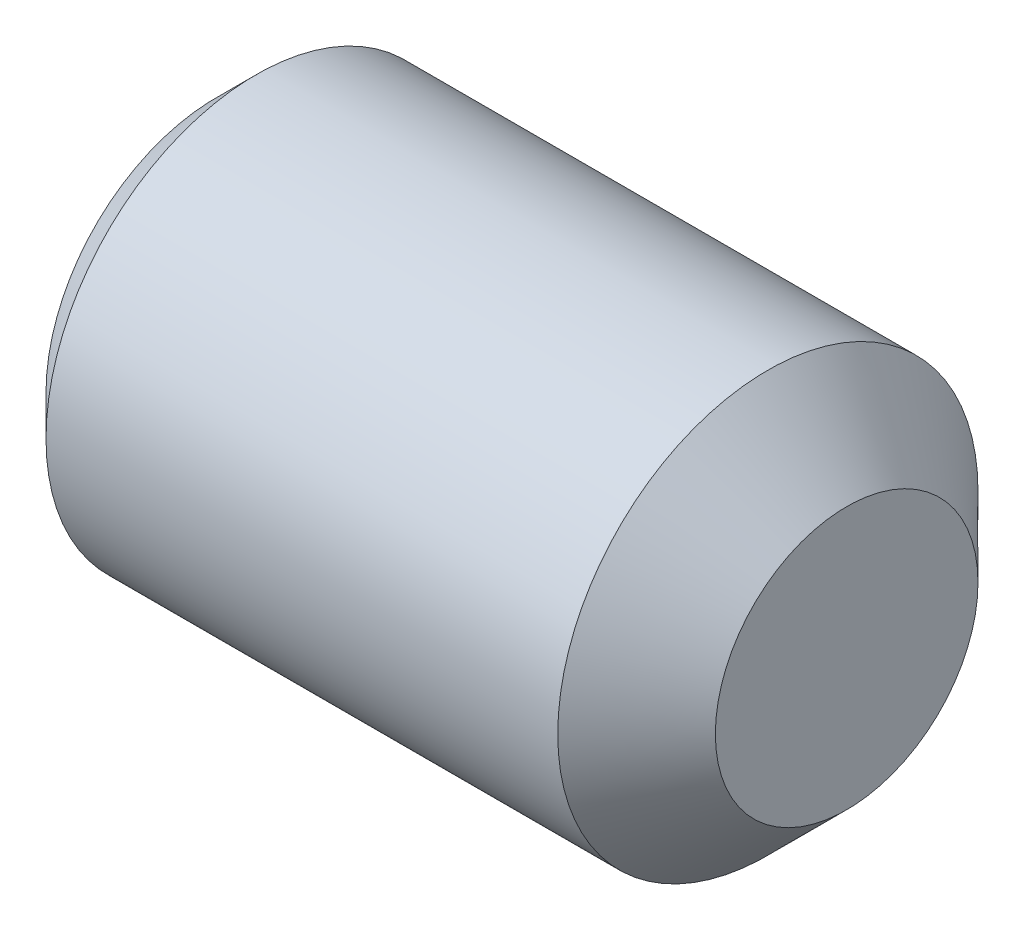
ISO-10303-21;
HEADER;
FILE_DESCRIPTION(('STEP AP214'),'2;1');
FILE_NAME('part.step','',(''),(''),'','','');
FILE_SCHEMA(('AUTOMOTIVE_DESIGN { 1 0 10303 214 1 1 1 1 }'));
ENDSEC;
DATA;
#1=APPLICATION_CONTEXT('core data for automotive mechanical design processes');
#2=APPLICATION_PROTOCOL_DEFINITION('international standard','automotive_design',2000,#1);
#3=PRODUCT_CONTEXT('',#1,'mechanical');
#4=PRODUCT('Part','Part','',(#3));
#5=PRODUCT_RELATED_PRODUCT_CATEGORY('part','',(#4));
#6=PRODUCT_DEFINITION_FORMATION('','',#4);
#7=PRODUCT_DEFINITION_CONTEXT('part definition',#1,'design');
#8=PRODUCT_DEFINITION('design','',#6,#7);
#9=PRODUCT_DEFINITION_SHAPE('','',#8);
#10=(LENGTH_UNIT() NAMED_UNIT(*) SI_UNIT(.MILLI.,.METRE.));
#11=(NAMED_UNIT(*) PLANE_ANGLE_UNIT() SI_UNIT($,.RADIAN.));
#12=(NAMED_UNIT(*) SI_UNIT($,.STERADIAN.) SOLID_ANGLE_UNIT());
#13=UNCERTAINTY_MEASURE_WITH_UNIT(LENGTH_MEASURE(1.E-05),#10,'distance_accuracy_value','');
#14=(GEOMETRIC_REPRESENTATION_CONTEXT(3) GLOBAL_UNCERTAINTY_ASSIGNED_CONTEXT((#13)) GLOBAL_UNIT_ASSIGNED_CONTEXT((#10,
#11,#12)) REPRESENTATION_CONTEXT('',''));
#15=CARTESIAN_POINT('',(0.,0.,0.));
#16=DIRECTION('',(0.,0.,1.));
#17=DIRECTION('',(1.,0.,0.));
#18=AXIS2_PLACEMENT_3D('',#15,#16,#17);
#19=CARTESIAN_POINT('',(1.50000000011356,-1.00000000000017,0.577350269189637));
#20=DIRECTION('',(1.,0.,0.));
#21=DIRECTION('',(0.,0.,-0.999999999999998));
#22=AXIS2_PLACEMENT_3D('',#19,#20,#21);
#23=PLANE('',#22);
#24=CARTESIAN_POINT('',(1.50000000011363,0.,0.));
#25=DIRECTION('',(-1.,0.,0.));
#26=DIRECTION('',(0.,0.,0.999999999999998));
#27=AXIS2_PLACEMENT_3D('',#24,#25,#26);
#28=CIRCLE('',#27,1.);
#29=CARTESIAN_POINT('',(1.50000000011362,0.499999999999806,0.866025403784443));
#30=VERTEX_POINT('',#29);
#31=CARTESIAN_POINT('',(1.50000000011372,0.999999999999779,0.));
#32=VERTEX_POINT('',#31);
#33=EDGE_CURVE('E50',#30,#32,#28,.T.);
#34=ORIENTED_EDGE('',*,*,#33,.F.);
#35=DIRECTION('',(0.,0.866025403784439,-0.499999999999999));
#36=VECTOR('',#35,1.);
#37=CARTESIAN_POINT('',(1.50000000011363,-1.11022302462516E-13,1.15470053837926));
#38=LINE('',#37,#36);
#39=CARTESIAN_POINT('',(1.50000000011367,0.999999999999834,0.577350269189644));
#40=VERTEX_POINT('',#39);
#41=EDGE_CURVE('E163',#30,#40,#38,.T.);
#42=ORIENTED_EDGE('',*,*,#41,.T.);
#43=DIRECTION('',(0.,0.,-0.999999999999998));
#44=VECTOR('',#43,1.);
#45=CARTESIAN_POINT('',(1.50000000011367,0.999999999999834,0.577350269189644));
#46=LINE('',#45,#44);
#47=EDGE_CURVE('E167',#40,#32,#46,.T.);
#48=ORIENTED_EDGE('',*,*,#47,.T.);
#49=EDGE_LOOP('',(#34,#42,#48));
#50=FACE_BOUND('',#49,.T.);
#51=ADVANCED_FACE('F39',(#50),#23,.F.);
#52=CARTESIAN_POINT('',(1.50000000011359,0.499999999999806,-0.866025403784434));
#53=VERTEX_POINT('',#52);
#54=EDGE_CURVE('E11',#32,#53,#28,.T.);
#55=ORIENTED_EDGE('',*,*,#54,.F.);
#56=CARTESIAN_POINT('',(1.5000000001136,0.999999999999751,-0.577350269189619));
#57=VERTEX_POINT('',#56);
#58=EDGE_CURVE('E166',#32,#57,#46,.T.);
#59=ORIENTED_EDGE('',*,*,#58,.T.);
#60=DIRECTION('',(0.,-0.866025403784439,-0.499999999999998));
#61=VECTOR('',#60,1.);
#62=CARTESIAN_POINT('',(1.5000000001136,0.999999999999751,-0.577350269189619));
#63=LINE('',#62,#61);
#64=EDGE_CURVE('E171',#57,#53,#63,.T.);
#65=ORIENTED_EDGE('',*,*,#64,.T.);
#66=EDGE_LOOP('',(#55,#59,#65));
#67=FACE_BOUND('',#66,.T.);
#68=ADVANCED_FACE('F126',(#67),#23,.F.);
#69=CARTESIAN_POINT('',(1.50000000011367,-0.500000000000139,-0.866025403784429));
#70=VERTEX_POINT('',#69);
#71=EDGE_CURVE('E48',#53,#70,#28,.T.);
#72=ORIENTED_EDGE('',*,*,#71,.F.);
#73=CARTESIAN_POINT('',(1.50000000011359,-1.66533453693773E-13,-1.15470053837924));
#74=VERTEX_POINT('',#73);
#75=EDGE_CURVE('E170',#53,#74,#63,.T.);
#76=ORIENTED_EDGE('',*,*,#75,.T.);
#77=DIRECTION('',(0.,-0.866025403784439,0.499999999999999));
#78=VECTOR('',#77,1.);
#79=CARTESIAN_POINT('',(1.50000000011359,-1.66533453693773E-13,-1.15470053837924));
#80=LINE('',#79,#78);
#81=EDGE_CURVE('E175',#74,#70,#80,.T.);
#82=ORIENTED_EDGE('',*,*,#81,.T.);
#83=EDGE_LOOP('',(#72,#76,#82));
#84=FACE_BOUND('',#83,.T.);
#85=ADVANCED_FACE('F132',(#84),#23,.F.);
#86=CARTESIAN_POINT('',(1.50000000011366,-1.0000000000002,0.));
#87=VERTEX_POINT('',#86);
#88=EDGE_CURVE('E275',#70,#87,#28,.T.);
#89=ORIENTED_EDGE('',*,*,#88,.F.);
#90=CARTESIAN_POINT('',(1.50000000011359,-1.00000000000014,-0.577350269189618));
#91=VERTEX_POINT('',#90);
#92=EDGE_CURVE('E174',#70,#91,#80,.T.);
#93=ORIENTED_EDGE('',*,*,#92,.T.);
#94=DIRECTION('',(0.,0.,0.999999999999998));
#95=VECTOR('',#94,1.);
#96=CARTESIAN_POINT('',(1.50000000011359,-1.00000000000014,-0.577350269189618));
#97=LINE('',#96,#95);
#98=EDGE_CURVE('E178',#91,#87,#97,.T.);
#99=ORIENTED_EDGE('',*,*,#98,.T.);
#100=EDGE_LOOP('',(#89,#93,#99));
#101=FACE_BOUND('',#100,.T.);
#102=ADVANCED_FACE('F145',(#101),#23,.F.);
#103=CARTESIAN_POINT('',(1.50000000011356,-0.500000000000111,0.866025403784439));
#104=VERTEX_POINT('',#103);
#105=EDGE_CURVE('E57',#87,#104,#28,.T.);
#106=ORIENTED_EDGE('',*,*,#105,.F.);
#107=CARTESIAN_POINT('',(1.50000000011356,-1.00000000000017,0.577350269189637));
#108=VERTEX_POINT('',#107);
#109=EDGE_CURVE('E161',#87,#108,#97,.T.);
#110=ORIENTED_EDGE('',*,*,#109,.T.);
#111=DIRECTION('',(0.,0.866025403784439,0.499999999999999));
#112=VECTOR('',#111,1.);
#113=CARTESIAN_POINT('',(1.50000000011356,-1.00000000000017,0.577350269189637));
#114=LINE('',#113,#112);
#115=EDGE_CURVE('E156',#108,#104,#114,.T.);
#116=ORIENTED_EDGE('',*,*,#115,.T.);
#117=EDGE_LOOP('',(#106,#110,#116));
#118=FACE_BOUND('',#117,.T.);
#119=ADVANCED_FACE('F137',(#118),#23,.F.);
#120=EDGE_CURVE('E148',#104,#30,#28,.T.);
#121=ORIENTED_EDGE('',*,*,#120,.F.);
#122=CARTESIAN_POINT('',(1.50000000011363,-1.11022302462516E-13,1.15470053837926));
#123=VERTEX_POINT('',#122);
#124=EDGE_CURVE('E150',#104,#123,#114,.T.);
#125=ORIENTED_EDGE('',*,*,#124,.T.);
#126=EDGE_CURVE('E152',#123,#30,#38,.T.);
#127=ORIENTED_EDGE('',*,*,#126,.T.);
#128=EDGE_LOOP('',(#121,#125,#127));
#129=FACE_BOUND('',#128,.T.);
#130=ADVANCED_FACE('F128',(#129),#23,.F.);
#131=CARTESIAN_POINT('',(0.,1.62099999999979,0.));
#132=DIRECTION('',(1.,0.,0.));
#133=DIRECTION('',(0.,0.,-0.999999999999998));
#134=AXIS2_PLACEMENT_3D('',#131,#132,#133);
#135=PLANE('',#134);
#136=DIRECTION('',(0.,0.866025403784439,-0.499999999999999));
#137=VECTOR('',#136,1.);
#138=CARTESIAN_POINT('',(1.13617448782577E-10,0.,1.15470053837926));
#139=LINE('',#138,#137);
#140=CARTESIAN_POINT('',(0.,0.,1.15470053837926));
#141=VERTEX_POINT('',#140);
#142=CARTESIAN_POINT('',(1.13575815419154E-10,0.999999999999751,0.577350269189626));
#143=VERTEX_POINT('',#142);
#144=EDGE_CURVE('E182',#141,#143,#139,.T.);
#145=ORIENTED_EDGE('',*,*,#144,.F.);
#146=DIRECTION('',(0.,0.866025403784439,0.499999999999999));
#147=VECTOR('',#146,1.);
#148=CARTESIAN_POINT('',(1.13575815419154E-10,-1.00000000000017,0.577350269189633));
#149=LINE('',#148,#147);
#150=CARTESIAN_POINT('',(1.13575815419154E-10,-1.00000000000017,0.577350269189633));
#151=VERTEX_POINT('',#150);
#152=EDGE_CURVE('E65',#151,#141,#149,.T.);
#153=ORIENTED_EDGE('',*,*,#152,.F.);
#154=DIRECTION('',(0.,0.,0.999999999999998));
#155=VECTOR('',#154,1.);
#156=CARTESIAN_POINT('',(1.13617448782577E-10,-1.00000000000011,-0.577350269189616));
#157=LINE('',#156,#155);
#158=CARTESIAN_POINT('',(1.13617448782577E-10,-1.00000000000011,-0.577350269189616));
#159=VERTEX_POINT('',#158);
#160=EDGE_CURVE('E158',#159,#151,#157,.T.);
#161=ORIENTED_EDGE('',*,*,#160,.F.);
#162=DIRECTION('',(0.,-0.866025403784439,0.499999999999999));
#163=VECTOR('',#162,1.);
#164=CARTESIAN_POINT('',(1.13603570994769E-10,-1.94289029309402E-13,-1.15470053837924));
#165=LINE('',#164,#163);
#166=CARTESIAN_POINT('',(1.13603570994769E-10,-1.94289029309402E-13,-1.15470053837924));
#167=VERTEX_POINT('',#166);
#168=EDGE_CURVE('E191',#167,#159,#165,.T.);
#169=ORIENTED_EDGE('',*,*,#168,.F.);
#170=DIRECTION('',(0.,-0.866025403784439,-0.499999999999998));
#171=VECTOR('',#170,1.);
#172=CARTESIAN_POINT('',(1.13603570994769E-10,0.999999999999779,-0.577350269189626));
#173=LINE('',#172,#171);
#174=CARTESIAN_POINT('',(1.13603570994769E-10,0.999999999999779,-0.577350269189626));
#175=VERTEX_POINT('',#174);
#176=EDGE_CURVE('E188',#175,#167,#173,.T.);
#177=ORIENTED_EDGE('',*,*,#176,.F.);
#178=DIRECTION('',(0.,0.,-0.999999999999998));
#179=VECTOR('',#178,1.);
#180=CARTESIAN_POINT('',(1.13575815419154E-10,0.999999999999751,0.577350269189626));
#181=LINE('',#180,#179);
#182=EDGE_CURVE('E185',#143,#175,#181,.T.);
#183=ORIENTED_EDGE('',*,*,#182,.F.);
#184=EDGE_LOOP('',(#145,#153,#161,#169,#177,#183));
#185=FACE_BOUND('',#184,.T.);
#186=CARTESIAN_POINT('',(0.,0.,0.));
#187=DIRECTION('',(-1.,0.,0.));
#188=DIRECTION('',(0.,0.,0.999999999999998));
#189=AXIS2_PLACEMENT_3D('',#186,#187,#188);
#190=CIRCLE('',#189,1.621);
#191=CARTESIAN_POINT('',(0.,0.,1.621));
#192=VERTEX_POINT('',#191);
#193=EDGE_CURVE('E198',#192,#192,#190,.T.);
#194=ORIENTED_EDGE('',*,*,#193,.T.);
#195=EDGE_LOOP('',(#194));
#196=FACE_BOUND('',#195,.T.);
#197=ADVANCED_FACE('F41',(#185,#196),#135,.F.);
#198=CARTESIAN_POINT('',(6.00000000000005,0.,0.));
#199=DIRECTION('',(-1.,0.,0.));
#200=DIRECTION('',(0.,0.,0.999999999999998));
#201=AXIS2_PLACEMENT_3D('',#198,#199,#200);
#202=PLANE('',#201);
#203=CARTESIAN_POINT('',(6.00000000000005,0.,0.));
#204=DIRECTION('',(-1.,0.,0.));
#205=DIRECTION('',(0.,0.,0.999999999999998));
#206=AXIS2_PLACEMENT_3D('',#203,#204,#205);
#207=CIRCLE('',#206,1.25);
#208=CARTESIAN_POINT('',(6.00000000000005,0.,1.24999999999998));
#209=VERTEX_POINT('',#208);
#210=EDGE_CURVE('E43',#209,#209,#207,.T.);
#211=ORIENTED_EDGE('',*,*,#210,.F.);
#212=EDGE_LOOP('',(#211));
#213=FACE_BOUND('',#212,.T.);
#214=ADVANCED_FACE('F143',(#213),#202,.F.);
#215=CARTESIAN_POINT('',(6.00000000000005,0.,0.));
#216=DIRECTION('',(-1.,0.,0.));
#217=DIRECTION('',(0.,0.,0.999999999999998));
#218=AXIS2_PLACEMENT_3D('',#215,#216,#217);
#219=CONICAL_SURFACE('',#218,1.25,0.785398163397443);
#220=CARTESIAN_POINT('',(5.25,0.,0.));
#221=DIRECTION('',(-1.,0.,0.));
#222=DIRECTION('',(0.,0.,0.999999999999998));
#223=AXIS2_PLACEMENT_3D('',#220,#221,#222);
#224=CIRCLE('',#223,2.);
#225=CARTESIAN_POINT('',(5.25,0.,1.99999999999999));
#226=VERTEX_POINT('',#225);
#227=EDGE_CURVE('E213',#226,#226,#224,.T.);
#228=ORIENTED_EDGE('',*,*,#227,.F.);
#229=EDGE_LOOP('',(#228));
#230=FACE_BOUND('',#229,.T.);
#231=ORIENTED_EDGE('',*,*,#210,.T.);
#232=EDGE_LOOP('',(#231));
#233=FACE_BOUND('',#232,.T.);
#234=ADVANCED_FACE('F220',(#230,#233),#219,.T.);
#235=CARTESIAN_POINT('',(-10.7450145430879,0.,0.));
#236=DIRECTION('',(-1.,0.,0.));
#237=DIRECTION('',(0.,0.,0.999999999999998));
#238=AXIS2_PLACEMENT_3D('',#235,#236,#237);
#239=CYLINDRICAL_SURFACE('',#238,2.);
#240=CARTESIAN_POINT('',(0.378999999999949,0.,0.));
#241=DIRECTION('',(-1.,0.,0.));
#242=DIRECTION('',(0.,0.,0.999999999999998));
#243=AXIS2_PLACEMENT_3D('',#240,#241,#242);
#244=CIRCLE('',#243,2.);
#245=CARTESIAN_POINT('',(0.378999999999949,0.,1.99999999999999));
#246=VERTEX_POINT('',#245);
#247=EDGE_CURVE('E211',#246,#246,#244,.T.);
#248=ORIENTED_EDGE('',*,*,#247,.F.);
#249=EDGE_LOOP('',(#248));
#250=FACE_BOUND('',#249,.T.);
#251=ORIENTED_EDGE('',*,*,#227,.T.);
#252=EDGE_LOOP('',(#251));
#253=FACE_BOUND('',#252,.T.);
#254=ADVANCED_FACE('F226',(#250,#253),#239,.T.);
#255=CARTESIAN_POINT('',(0.378999999999949,0.,0.));
#256=DIRECTION('',(1.,0.,0.));
#257=DIRECTION('',(0.,0.,-0.999999999999998));
#258=AXIS2_PLACEMENT_3D('',#255,#256,#257);
#259=CONICAL_SURFACE('',#258,2.,0.785398163397442);
#260=ORIENTED_EDGE('',*,*,#193,.F.);
#261=EDGE_LOOP('',(#260));
#262=FACE_BOUND('',#261,.T.);
#263=ORIENTED_EDGE('',*,*,#247,.T.);
#264=EDGE_LOOP('',(#263));
#265=FACE_BOUND('',#264,.T.);
#266=ADVANCED_FACE('F232',(#262,#265),#259,.T.);
#267=CARTESIAN_POINT('',(1.50000000011356,-1.00000000000017,0.577350269189637));
#268=DIRECTION('',(0.,-0.5,0.866025403784437));
#269=DIRECTION('',(0.,-0.866025403784439,-0.499999999999999));
#270=AXIS2_PLACEMENT_3D('',#267,#268,#269);
#271=PLANE('',#270);
#272=ORIENTED_EDGE('',*,*,#152,.T.);
#273=DIRECTION('',(-1.,0.,0.));
#274=VECTOR('',#273,1.);
#275=CARTESIAN_POINT('',(1.50000000011363,-1.11022302462516E-13,1.15470053837926));
#276=LINE('',#275,#274);
#277=EDGE_CURVE('E157',#123,#141,#276,.T.);
#278=ORIENTED_EDGE('',*,*,#277,.F.);
#279=ORIENTED_EDGE('',*,*,#124,.F.);
#280=ORIENTED_EDGE('',*,*,#115,.F.);
#281=DIRECTION('',(-1.,0.,0.));
#282=VECTOR('',#281,1.);
#283=CARTESIAN_POINT('',(1.50000000011356,-1.00000000000017,0.577350269189637));
#284=LINE('',#283,#282);
#285=EDGE_CURVE('E196',#108,#151,#284,.T.);
#286=ORIENTED_EDGE('',*,*,#285,.T.);
#287=EDGE_LOOP('',(#272,#278,#279,#280,#286));
#288=FACE_BOUND('',#287,.T.);
#289=ADVANCED_FACE('F155',(#288),#271,.F.);
#290=CARTESIAN_POINT('',(1.50000000011359,-1.00000000000014,-0.577350269189618));
#291=DIRECTION('',(0.,-1.,0.));
#292=DIRECTION('',(0.,0.,-0.999999999999998));
#293=AXIS2_PLACEMENT_3D('',#290,#291,#292);
#294=PLANE('',#293);
#295=ORIENTED_EDGE('',*,*,#160,.T.);
#296=ORIENTED_EDGE('',*,*,#285,.F.);
#297=ORIENTED_EDGE('',*,*,#109,.F.);
#298=ORIENTED_EDGE('',*,*,#98,.F.);
#299=DIRECTION('',(-1.,0.,0.));
#300=VECTOR('',#299,1.);
#301=CARTESIAN_POINT('',(1.50000000011359,-1.00000000000014,-0.577350269189618));
#302=LINE('',#301,#300);
#303=EDGE_CURVE('E199',#91,#159,#302,.T.);
#304=ORIENTED_EDGE('',*,*,#303,.T.);
#305=EDGE_LOOP('',(#295,#296,#297,#298,#304));
#306=FACE_BOUND('',#305,.T.);
#307=ADVANCED_FACE('F238',(#306),#294,.F.);
#308=CARTESIAN_POINT('',(1.50000000011359,-1.66533453693773E-13,-1.15470053837924));
#309=DIRECTION('',(0.,-0.5,-0.866025403784437));
#310=DIRECTION('',(0.,0.866025403784439,-0.499999999999999));
#311=AXIS2_PLACEMENT_3D('',#308,#309,#310);
#312=PLANE('',#311);
#313=ORIENTED_EDGE('',*,*,#168,.T.);
#314=ORIENTED_EDGE('',*,*,#303,.F.);
#315=ORIENTED_EDGE('',*,*,#92,.F.);
#316=ORIENTED_EDGE('',*,*,#81,.F.);
#317=DIRECTION('',(-1.,0.,0.));
#318=VECTOR('',#317,1.);
#319=CARTESIAN_POINT('',(1.50000000011359,-1.66533453693773E-13,-1.15470053837924));
#320=LINE('',#319,#318);
#321=EDGE_CURVE('E201',#74,#167,#320,.T.);
#322=ORIENTED_EDGE('',*,*,#321,.T.);
#323=EDGE_LOOP('',(#313,#314,#315,#316,#322));
#324=FACE_BOUND('',#323,.T.);
#325=ADVANCED_FACE('F246',(#324),#312,.F.);
#326=CARTESIAN_POINT('',(1.5000000001136,0.999999999999751,-0.577350269189619));
#327=DIRECTION('',(0.,0.5,-0.866025403784437));
#328=DIRECTION('',(0.,0.866025403784439,0.499999999999999));
#329=AXIS2_PLACEMENT_3D('',#326,#327,#328);
#330=PLANE('',#329);
#331=ORIENTED_EDGE('',*,*,#176,.T.);
#332=ORIENTED_EDGE('',*,*,#321,.F.);
#333=ORIENTED_EDGE('',*,*,#75,.F.);
#334=ORIENTED_EDGE('',*,*,#64,.F.);
#335=DIRECTION('',(-1.,0.,0.));
#336=VECTOR('',#335,1.);
#337=CARTESIAN_POINT('',(1.5000000001136,0.999999999999751,-0.577350269189619));
#338=LINE('',#337,#336);
#339=EDGE_CURVE('E203',#57,#175,#338,.T.);
#340=ORIENTED_EDGE('',*,*,#339,.T.);
#341=EDGE_LOOP('',(#331,#332,#333,#334,#340));
#342=FACE_BOUND('',#341,.T.);
#343=ADVANCED_FACE('F242',(#342),#330,.F.);
#344=CARTESIAN_POINT('',(1.50000000011367,0.999999999999834,0.577350269189644));
#345=DIRECTION('',(0.,1.,0.));
#346=DIRECTION('',(0.,0.,0.999999999999998));
#347=AXIS2_PLACEMENT_3D('',#344,#345,#346);
#348=PLANE('',#347);
#349=ORIENTED_EDGE('',*,*,#182,.T.);
#350=ORIENTED_EDGE('',*,*,#339,.F.);
#351=ORIENTED_EDGE('',*,*,#58,.F.);
#352=ORIENTED_EDGE('',*,*,#47,.F.);
#353=DIRECTION('',(-1.,0.,0.));
#354=VECTOR('',#353,1.);
#355=CARTESIAN_POINT('',(1.50000000011367,0.999999999999834,0.577350269189644));
#356=LINE('',#355,#354);
#357=EDGE_CURVE('E205',#40,#143,#356,.T.);
#358=ORIENTED_EDGE('',*,*,#357,.T.);
#359=EDGE_LOOP('',(#349,#350,#351,#352,#358));
#360=FACE_BOUND('',#359,.T.);
#361=ADVANCED_FACE('F121',(#360),#348,.F.);
#362=CARTESIAN_POINT('',(1.50000000011363,-1.11022302462516E-13,1.15470053837926));
#363=DIRECTION('',(0.,0.5,0.866025403784437));
#364=DIRECTION('',(0.,-0.866025403784439,0.499999999999999));
#365=AXIS2_PLACEMENT_3D('',#362,#363,#364);
#366=PLANE('',#365);
#367=ORIENTED_EDGE('',*,*,#144,.T.);
#368=ORIENTED_EDGE('',*,*,#357,.F.);
#369=ORIENTED_EDGE('',*,*,#41,.F.);
#370=ORIENTED_EDGE('',*,*,#126,.F.);
#371=ORIENTED_EDGE('',*,*,#277,.T.);
#372=EDGE_LOOP('',(#367,#368,#369,#370,#371));
#373=FACE_BOUND('',#372,.T.);
#374=ADVANCED_FACE('F116',(#373),#366,.F.);
#375=CARTESIAN_POINT('',(2.0773502693032,-1.11022302462516E-13,0.));
#376=DIRECTION('',(-1.,0.,0.));
#377=DIRECTION('',(0.,0.,0.999999999999998));
#378=AXIS2_PLACEMENT_3D('',#375,#376,#377);
#379=CONICAL_SURFACE('',#378,0.,1.0471975511966);
#380=ORIENTED_EDGE('',*,*,#33,.T.);
#381=ORIENTED_EDGE('',*,*,#54,.T.);
#382=ORIENTED_EDGE('',*,*,#71,.T.);
#383=ORIENTED_EDGE('',*,*,#88,.T.);
#384=ORIENTED_EDGE('',*,*,#105,.T.);
#385=ORIENTED_EDGE('',*,*,#120,.T.);
#386=EDGE_LOOP('',(#380,#381,#382,#383,#384,#385));
#387=FACE_BOUND('',#386,.T.);
#388=CARTESIAN_POINT('',(2.0773502693032,-1.11022302462516E-13,0.));
#389=VERTEX_POINT('',#388);
#390=VERTEX_LOOP('',#389);
#391=FACE_BOUND('',#390,.T.);
#392=ADVANCED_FACE('F114',(#387,#391),#379,.F.);
#393=CLOSED_SHELL('',(#51,#68,#85,#102,#119,#130,#197,#214,#234,#254,#266,#289,#307,#325,#343,
#361,#374,#392));
#394=MANIFOLD_SOLID_BREP('B2',#393);
#395=ADVANCED_BREP_SHAPE_REPRESENTATION('',(#18,#394),#14);
#396=SHAPE_DEFINITION_REPRESENTATION(#9,#395);
ENDSEC;
END-ISO-10303-21;
